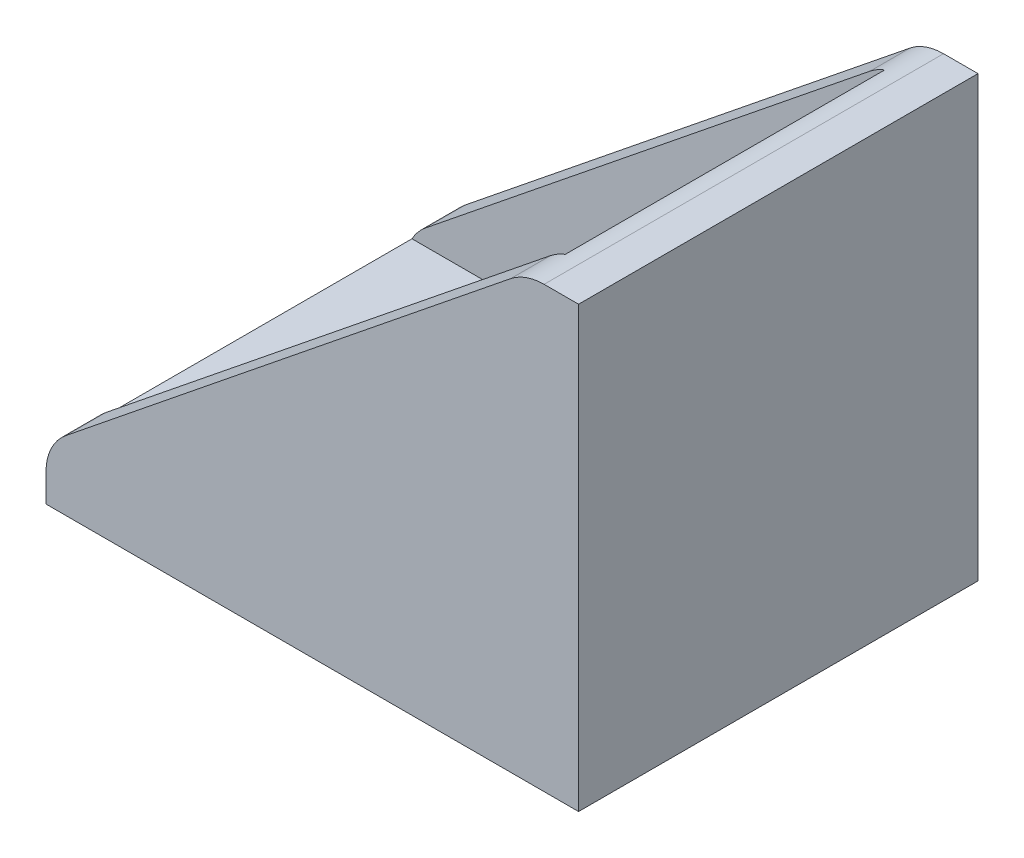
ISO-10303-21;
HEADER;
FILE_DESCRIPTION(('STEP AP214'),'2;1');
FILE_NAME('part.step','',(''),(''),'','','');
FILE_SCHEMA(('AUTOMOTIVE_DESIGN { 1 0 10303 214 1 1 1 1 }'));
ENDSEC;
DATA;
#1=APPLICATION_CONTEXT('core data for automotive mechanical design processes');
#2=APPLICATION_PROTOCOL_DEFINITION('international standard','automotive_design',2000,#1);
#3=PRODUCT_CONTEXT('',#1,'mechanical');
#4=PRODUCT('Part','Part','',(#3));
#5=PRODUCT_RELATED_PRODUCT_CATEGORY('part','',(#4));
#6=PRODUCT_DEFINITION_FORMATION('','',#4);
#7=PRODUCT_DEFINITION_CONTEXT('part definition',#1,'design');
#8=PRODUCT_DEFINITION('design','',#6,#7);
#9=PRODUCT_DEFINITION_SHAPE('','',#8);
#10=(LENGTH_UNIT() NAMED_UNIT(*) SI_UNIT(.MILLI.,.METRE.));
#11=(NAMED_UNIT(*) PLANE_ANGLE_UNIT() SI_UNIT($,.RADIAN.));
#12=(NAMED_UNIT(*) SI_UNIT($,.STERADIAN.) SOLID_ANGLE_UNIT());
#13=UNCERTAINTY_MEASURE_WITH_UNIT(LENGTH_MEASURE(1.E-05),#10,'distance_accuracy_value','');
#14=(GEOMETRIC_REPRESENTATION_CONTEXT(3) GLOBAL_UNCERTAINTY_ASSIGNED_CONTEXT((#13)) GLOBAL_UNIT_ASSIGNED_CONTEXT((#10,
#11,#12)) REPRESENTATION_CONTEXT('',''));
#15=CARTESIAN_POINT('',(0.,0.,0.));
#16=DIRECTION('',(0.,0.,1.));
#17=DIRECTION('',(1.,0.,0.));
#18=AXIS2_PLACEMENT_3D('',#15,#16,#17);
#19=CARTESIAN_POINT('',(-50.8,0.,38.1));
#20=DIRECTION('',(1.,0.,0.));
#21=DIRECTION('',(0.,0.,-1.));
#22=AXIS2_PLACEMENT_3D('',#19,#20,#21);
#23=PLANE('',#22);
#24=DIRECTION('',(0.,-1.,0.));
#25=VECTOR('',#24,1.);
#26=CARTESIAN_POINT('',(-50.8,0.,38.1));
#27=LINE('',#26,#25);
#28=CARTESIAN_POINT('',(-50.8,2.64898048854031,38.1));
#29=VERTEX_POINT('',#28);
#30=CARTESIAN_POINT('',(-50.8,0.,38.1));
#31=VERTEX_POINT('',#30);
#32=EDGE_CURVE('E204',#29,#31,#27,.T.);
#33=ORIENTED_EDGE('',*,*,#32,.F.);
#34=DIRECTION('',(0.,0.,-1.));
#35=VECTOR('',#34,1.);
#36=CARTESIAN_POINT('',(-50.8,2.64898048854031,0.));
#37=LINE('',#36,#35);
#38=CARTESIAN_POINT('',(-50.8,2.64898048854031,0.));
#39=VERTEX_POINT('',#38);
#40=EDGE_CURVE('E233',#29,#39,#37,.T.);
#41=ORIENTED_EDGE('',*,*,#40,.T.);
#42=DIRECTION('',(0.,-1.,0.));
#43=VECTOR('',#42,1.);
#44=CARTESIAN_POINT('',(-50.8,0.,0.));
#45=LINE('',#44,#43);
#46=CARTESIAN_POINT('',(-50.8,0.,0.));
#47=VERTEX_POINT('',#46);
#48=EDGE_CURVE('E201',#39,#47,#45,.T.);
#49=ORIENTED_EDGE('',*,*,#48,.T.);
#50=DIRECTION('',(0.,0.,-1.));
#51=VECTOR('',#50,1.);
#52=CARTESIAN_POINT('',(-50.8,0.,38.1));
#53=LINE('',#52,#51);
#54=EDGE_CURVE('E230',#31,#47,#53,.T.);
#55=ORIENTED_EDGE('',*,*,#54,.F.);
#56=EDGE_LOOP('',(#33,#41,#49,#55));
#57=FACE_BOUND('',#56,.T.);
#58=ADVANCED_FACE('F33',(#57),#23,.F.);
#59=CARTESIAN_POINT('',(-50.8,0.,38.1));
#60=DIRECTION('',(0.,1.,0.));
#61=DIRECTION('',(0.,0.,1.));
#62=AXIS2_PLACEMENT_3D('',#59,#60,#61);
#63=PLANE('',#62);
#64=DIRECTION('',(1.,0.,0.));
#65=VECTOR('',#64,1.);
#66=CARTESIAN_POINT('',(-40.3302771203879,0.,15.875));
#67=LINE('',#66,#65);
#68=CARTESIAN_POINT('',(-40.3302771203879,0.,15.875));
#69=VERTEX_POINT('',#68);
#70=CARTESIAN_POINT('',(-14.9302771203879,0.,15.875));
#71=VERTEX_POINT('',#70);
#72=EDGE_CURVE('E165',#69,#71,#67,.T.);
#73=ORIENTED_EDGE('',*,*,#72,.F.);
#74=CARTESIAN_POINT('',(-40.3302771203879,0.,19.05));
#75=DIRECTION('',(0.,1.,0.));
#76=DIRECTION('',(0.,0.,1.));
#77=AXIS2_PLACEMENT_3D('',#74,#75,#76);
#78=CIRCLE('',#77,3.175);
#79=CARTESIAN_POINT('',(-40.3302771203879,0.,22.225));
#80=VERTEX_POINT('',#79);
#81=EDGE_CURVE('E147',#80,#69,#78,.F.);
#82=ORIENTED_EDGE('',*,*,#81,.F.);
#83=DIRECTION('',(-1.,0.,0.));
#84=VECTOR('',#83,1.);
#85=CARTESIAN_POINT('',(-40.3302771203879,0.,22.225));
#86=LINE('',#85,#84);
#87=CARTESIAN_POINT('',(-14.9302771203879,0.,22.225));
#88=VERTEX_POINT('',#87);
#89=EDGE_CURVE('E156',#88,#80,#86,.T.);
#90=ORIENTED_EDGE('',*,*,#89,.F.);
#91=CARTESIAN_POINT('',(-14.9302771203879,0.,19.05));
#92=DIRECTION('',(0.,1.,0.));
#93=DIRECTION('',(0.,0.,1.));
#94=AXIS2_PLACEMENT_3D('',#91,#92,#93);
#95=CIRCLE('',#94,3.175);
#96=EDGE_CURVE('E48',#71,#88,#95,.F.);
#97=ORIENTED_EDGE('',*,*,#96,.F.);
#98=EDGE_LOOP('',(#73,#82,#90,#97));
#99=FACE_BOUND('',#98,.T.);
#100=DIRECTION('',(1.,0.,0.));
#101=VECTOR('',#100,1.);
#102=CARTESIAN_POINT('',(-50.8,0.,0.));
#103=LINE('',#102,#101);
#104=CARTESIAN_POINT('',(0.,0.,0.));
#105=VERTEX_POINT('',#104);
#106=EDGE_CURVE('E216',#47,#105,#103,.T.);
#107=ORIENTED_EDGE('',*,*,#106,.T.);
#108=DIRECTION('',(0.,0.,-1.));
#109=VECTOR('',#108,1.);
#110=CARTESIAN_POINT('',(0.,0.,38.1));
#111=LINE('',#110,#109);
#112=CARTESIAN_POINT('',(0.,0.,38.1));
#113=VERTEX_POINT('',#112);
#114=EDGE_CURVE('E227',#113,#105,#111,.T.);
#115=ORIENTED_EDGE('',*,*,#114,.F.);
#116=DIRECTION('',(1.,0.,0.));
#117=VECTOR('',#116,1.);
#118=CARTESIAN_POINT('',(-50.8,0.,38.1));
#119=LINE('',#118,#117);
#120=EDGE_CURVE('E206',#31,#113,#119,.T.);
#121=ORIENTED_EDGE('',*,*,#120,.F.);
#122=ORIENTED_EDGE('',*,*,#54,.T.);
#123=EDGE_LOOP('',(#107,#115,#121,#122));
#124=FACE_BOUND('',#123,.T.);
#125=ADVANCED_FACE('F162',(#99,#124),#63,.F.);
#126=CARTESIAN_POINT('',(0.,0.,38.1));
#127=DIRECTION('',(-1.,0.,0.));
#128=DIRECTION('',(0.,0.,1.));
#129=AXIS2_PLACEMENT_3D('',#126,#127,#128);
#130=PLANE('',#129);
#131=DIRECTION('',(0.,1.,0.));
#132=VECTOR('',#131,1.);
#133=CARTESIAN_POINT('',(0.,0.,0.));
#134=LINE('',#133,#132);
#135=CARTESIAN_POINT('',(0.,41.91,0.));
#136=VERTEX_POINT('',#135);
#137=EDGE_CURVE('E218',#105,#136,#134,.T.);
#138=ORIENTED_EDGE('',*,*,#137,.T.);
#139=DIRECTION('',(0.,0.,-1.));
#140=VECTOR('',#139,1.);
#141=CARTESIAN_POINT('',(0.,41.91,38.1));
#142=LINE('',#141,#140);
#143=CARTESIAN_POINT('',(0.,41.91,38.1));
#144=VERTEX_POINT('',#143);
#145=EDGE_CURVE('E224',#144,#136,#142,.T.);
#146=ORIENTED_EDGE('',*,*,#145,.F.);
#147=DIRECTION('',(0.,1.,0.));
#148=VECTOR('',#147,1.);
#149=CARTESIAN_POINT('',(0.,0.,38.1));
#150=LINE('',#149,#148);
#151=EDGE_CURVE('E209',#113,#144,#150,.T.);
#152=ORIENTED_EDGE('',*,*,#151,.F.);
#153=ORIENTED_EDGE('',*,*,#114,.T.);
#154=EDGE_LOOP('',(#138,#146,#152,#153));
#155=FACE_BOUND('',#154,.T.);
#156=ADVANCED_FACE('F309',(#155),#130,.F.);
#157=CARTESIAN_POINT('',(0.,41.91,38.1));
#158=DIRECTION('',(0.,-1.,0.));
#159=DIRECTION('',(0.,0.,-1.));
#160=AXIS2_PLACEMENT_3D('',#157,#158,#159);
#161=PLANE('',#160);
#162=DIRECTION('',(-1.,0.,0.));
#163=VECTOR('',#162,1.);
#164=CARTESIAN_POINT('',(0.,41.91,0.));
#165=LINE('',#164,#163);
#166=CARTESIAN_POINT('',(-3.28838957198108,41.91,0.));
#167=VERTEX_POINT('',#166);
#168=EDGE_CURVE('E207',#136,#167,#165,.T.);
#169=ORIENTED_EDGE('',*,*,#168,.T.);
#170=DIRECTION('',(0.,0.,-1.));
#171=VECTOR('',#170,1.);
#172=CARTESIAN_POINT('',(-3.28838957198108,41.91,3.81000000000001));
#173=LINE('',#172,#171);
#174=CARTESIAN_POINT('',(-3.28838957198108,41.91,38.1));
#175=VERTEX_POINT('',#174);
#176=EDGE_CURVE('E41',#167,#175,#173,.F.);
#177=ORIENTED_EDGE('',*,*,#176,.T.);
#178=DIRECTION('',(-1.,0.,0.));
#179=VECTOR('',#178,1.);
#180=CARTESIAN_POINT('',(0.,41.91,38.1));
#181=LINE('',#180,#179);
#182=EDGE_CURVE('E211',#144,#175,#181,.T.);
#183=ORIENTED_EDGE('',*,*,#182,.F.);
#184=ORIENTED_EDGE('',*,*,#145,.T.);
#185=EDGE_LOOP('',(#169,#177,#183,#184));
#186=FACE_BOUND('',#185,.T.);
#187=ADVANCED_FACE('F265',(#186),#161,.F.);
#188=CARTESIAN_POINT('',(-5.08,5.08,38.1));
#189=DIRECTION('',(1.,0.,0.));
#190=DIRECTION('',(0.,0.,-1.));
#191=AXIS2_PLACEMENT_3D('',#188,#189,#190);
#192=PLANE('',#191);
#193=DIRECTION('',(0.,1.,0.));
#194=VECTOR('',#193,1.);
#195=CARTESIAN_POINT('',(-5.08,5.08,34.29));
#196=LINE('',#195,#194);
#197=CARTESIAN_POINT('',(-5.08,5.08,34.29));
#198=VERTEX_POINT('',#197);
#199=CARTESIAN_POINT('',(-5.08,41.5835809737727,34.29));
#200=VERTEX_POINT('',#199);
#201=EDGE_CURVE('E187',#198,#200,#196,.T.);
#202=ORIENTED_EDGE('',*,*,#201,.T.);
#203=DIRECTION('',(0.,0.,1.));
#204=VECTOR('',#203,1.);
#205=CARTESIAN_POINT('',(-5.08,41.5835809737727,34.29));
#206=LINE('',#205,#204);
#207=CARTESIAN_POINT('',(-5.08,41.5835809737727,3.81));
#208=VERTEX_POINT('',#207);
#209=EDGE_CURVE('E11',#200,#208,#206,.F.);
#210=ORIENTED_EDGE('',*,*,#209,.T.);
#211=DIRECTION('',(0.,1.,0.));
#212=VECTOR('',#211,1.);
#213=CARTESIAN_POINT('',(-5.08,5.08,3.81));
#214=LINE('',#213,#212);
#215=CARTESIAN_POINT('',(-5.08,5.08,3.81000000000001));
#216=VERTEX_POINT('',#215);
#217=EDGE_CURVE('E195',#216,#208,#214,.T.);
#218=ORIENTED_EDGE('',*,*,#217,.F.);
#219=DIRECTION('',(0.,0.,-1.));
#220=VECTOR('',#219,1.);
#221=CARTESIAN_POINT('',(-5.08,5.08,38.1));
#222=LINE('',#221,#220);
#223=EDGE_CURVE('E214',#198,#216,#222,.T.);
#224=ORIENTED_EDGE('',*,*,#223,.F.);
#225=EDGE_LOOP('',(#202,#210,#218,#224));
#226=FACE_BOUND('',#225,.T.);
#227=ADVANCED_FACE('F346',(#226),#192,.F.);
#228=CARTESIAN_POINT('',(-50.8,5.08,38.1));
#229=DIRECTION('',(0.,-1.,0.));
#230=DIRECTION('',(0.,0.,-1.));
#231=AXIS2_PLACEMENT_3D('',#228,#229,#230);
#232=PLANE('',#231);
#233=DIRECTION('',(1.,0.,0.));
#234=VECTOR('',#233,1.);
#235=CARTESIAN_POINT('',(-40.3302771203879,5.08,22.225));
#236=LINE('',#235,#234);
#237=CARTESIAN_POINT('',(-40.3302771203879,5.08,22.225));
#238=VERTEX_POINT('',#237);
#239=CARTESIAN_POINT('',(-14.9302771203879,5.08,22.225));
#240=VERTEX_POINT('',#239);
#241=EDGE_CURVE('E167',#238,#240,#236,.T.);
#242=ORIENTED_EDGE('',*,*,#241,.F.);
#243=CARTESIAN_POINT('',(-40.3302771203879,5.08,19.05));
#244=DIRECTION('',(0.,1.,0.));
#245=DIRECTION('',(0.,0.,1.));
#246=AXIS2_PLACEMENT_3D('',#243,#244,#245);
#247=CIRCLE('',#246,3.175);
#248=CARTESIAN_POINT('',(-40.3302771203879,5.08,15.875));
#249=VERTEX_POINT('',#248);
#250=EDGE_CURVE('E56',#249,#238,#247,.T.);
#251=ORIENTED_EDGE('',*,*,#250,.F.);
#252=DIRECTION('',(-1.,0.,0.));
#253=VECTOR('',#252,1.);
#254=CARTESIAN_POINT('',(-40.3302771203879,5.08,15.875));
#255=LINE('',#254,#253);
#256=CARTESIAN_POINT('',(-14.9302771203879,5.08,15.875));
#257=VERTEX_POINT('',#256);
#258=EDGE_CURVE('E153',#257,#249,#255,.T.);
#259=ORIENTED_EDGE('',*,*,#258,.F.);
#260=CARTESIAN_POINT('',(-14.9302771203879,5.08,19.05));
#261=DIRECTION('',(0.,1.,0.));
#262=DIRECTION('',(0.,0.,1.));
#263=AXIS2_PLACEMENT_3D('',#260,#261,#262);
#264=CIRCLE('',#263,3.175);
#265=EDGE_CURVE('E173',#240,#257,#264,.T.);
#266=ORIENTED_EDGE('',*,*,#265,.F.);
#267=EDGE_LOOP('',(#242,#251,#259,#266));
#268=FACE_BOUND('',#267,.T.);
#269=DIRECTION('',(1.,0.,0.));
#270=VECTOR('',#269,1.);
#271=CARTESIAN_POINT('',(-50.8,5.08,3.81));
#272=LINE('',#271,#270);
#273=CARTESIAN_POINT('',(-50.1805542407757,5.08,3.81));
#274=VERTEX_POINT('',#273);
#275=EDGE_CURVE('E193',#274,#216,#272,.T.);
#276=ORIENTED_EDGE('',*,*,#275,.F.);
#277=DIRECTION('',(0.,0.,1.));
#278=VECTOR('',#277,1.);
#279=CARTESIAN_POINT('',(-50.1805542407757,5.08,3.81));
#280=LINE('',#279,#278);
#281=CARTESIAN_POINT('',(-50.1805542407757,5.08,34.29));
#282=VERTEX_POINT('',#281);
#283=EDGE_CURVE('E249',#274,#282,#280,.T.);
#284=ORIENTED_EDGE('',*,*,#283,.T.);
#285=DIRECTION('',(1.,0.,0.));
#286=VECTOR('',#285,1.);
#287=CARTESIAN_POINT('',(-50.8,5.08,34.29));
#288=LINE('',#287,#286);
#289=EDGE_CURVE('E182',#282,#198,#288,.T.);
#290=ORIENTED_EDGE('',*,*,#289,.T.);
#291=ORIENTED_EDGE('',*,*,#223,.T.);
#292=EDGE_LOOP('',(#276,#284,#290,#291));
#293=FACE_BOUND('',#292,.T.);
#294=ADVANCED_FACE('F341',(#268,#293),#232,.F.);
#295=CARTESIAN_POINT('',(0.,0.,38.1));
#296=DIRECTION('',(0.,0.,-1.));
#297=DIRECTION('',(-1.,0.,0.));
#298=AXIS2_PLACEMENT_3D('',#295,#296,#297);
#299=PLANE('',#298);
#300=DIRECTION('',(0.778753909083283,0.627329537872645,0.));
#301=VECTOR('',#300,1.);
#302=CARTESIAN_POINT('',(-50.8,5.08,38.1));
#303=LINE('',#302,#301);
#304=CARTESIAN_POINT('',(-48.906834052393,6.60505034668339,38.1));
#305=VERTEX_POINT('',#304);
#306=CARTESIAN_POINT('',(-6.47522362437411,40.7860698581431,38.1));
#307=VERTEX_POINT('',#306);
#308=EDGE_CURVE('E159',#305,#307,#303,.T.);
#309=ORIENTED_EDGE('',*,*,#308,.F.);
#310=CARTESIAN_POINT('',(-45.72,2.64898048854031,38.1));
#311=DIRECTION('',(0.,0.,-1.));
#312=DIRECTION('',(-1.,0.,0.));
#313=AXIS2_PLACEMENT_3D('',#310,#311,#312);
#314=CIRCLE('',#313,5.08);
#315=EDGE_CURVE('E261',#305,#29,#314,.F.);
#316=ORIENTED_EDGE('',*,*,#315,.T.);
#317=ORIENTED_EDGE('',*,*,#32,.T.);
#318=ORIENTED_EDGE('',*,*,#120,.T.);
#319=ORIENTED_EDGE('',*,*,#151,.T.);
#320=ORIENTED_EDGE('',*,*,#182,.T.);
#321=CARTESIAN_POINT('',(-3.28838957198108,36.83,38.1));
#322=DIRECTION('',(0.,0.,-1.));
#323=DIRECTION('',(-1.,0.,0.));
#324=AXIS2_PLACEMENT_3D('',#321,#322,#323);
#325=CIRCLE('',#324,5.08);
#326=EDGE_CURVE('E259',#175,#307,#325,.F.);
#327=ORIENTED_EDGE('',*,*,#326,.T.);
#328=EDGE_LOOP('',(#309,#316,#317,#318,#319,#320,#327));
#329=FACE_BOUND('',#328,.T.);
#330=ADVANCED_FACE('F271',(#329),#299,.F.);
#331=CARTESIAN_POINT('',(0.,0.,0.));
#332=DIRECTION('',(0.,0.,-1.));
#333=DIRECTION('',(-1.,0.,0.));
#334=AXIS2_PLACEMENT_3D('',#331,#332,#333);
#335=PLANE('',#334);
#336=ORIENTED_EDGE('',*,*,#48,.F.);
#337=CARTESIAN_POINT('',(-45.72,2.64898048854031,0.));
#338=DIRECTION('',(0.,0.,-1.));
#339=DIRECTION('',(-1.,0.,0.));
#340=AXIS2_PLACEMENT_3D('',#337,#338,#339);
#341=CIRCLE('',#340,5.08);
#342=CARTESIAN_POINT('',(-48.906834052393,6.60505034668339,0.));
#343=VERTEX_POINT('',#342);
#344=EDGE_CURVE('E238',#39,#343,#341,.T.);
#345=ORIENTED_EDGE('',*,*,#344,.T.);
#346=DIRECTION('',(0.778753909083283,0.627329537872645,0.));
#347=VECTOR('',#346,1.);
#348=CARTESIAN_POINT('',(-50.8,5.08,0.));
#349=LINE('',#348,#347);
#350=CARTESIAN_POINT('',(-6.47522362437412,40.7860698581431,0.));
#351=VERTEX_POINT('',#350);
#352=EDGE_CURVE('E190',#343,#351,#349,.T.);
#353=ORIENTED_EDGE('',*,*,#352,.T.);
#354=CARTESIAN_POINT('',(-3.28838957198108,36.83,0.));
#355=DIRECTION('',(0.,0.,-1.));
#356=DIRECTION('',(-1.,0.,0.));
#357=AXIS2_PLACEMENT_3D('',#354,#355,#356);
#358=CIRCLE('',#357,5.08);
#359=EDGE_CURVE('E236',#351,#167,#358,.T.);
#360=ORIENTED_EDGE('',*,*,#359,.T.);
#361=ORIENTED_EDGE('',*,*,#168,.F.);
#362=ORIENTED_EDGE('',*,*,#137,.F.);
#363=ORIENTED_EDGE('',*,*,#106,.F.);
#364=EDGE_LOOP('',(#336,#345,#353,#360,#361,#362,#363));
#365=FACE_BOUND('',#364,.T.);
#366=ADVANCED_FACE('F300',(#365),#335,.T.);
#367=CARTESIAN_POINT('',(-50.8,5.08,3.81));
#368=DIRECTION('',(-0.627329537872645,0.778753909083283,0.));
#369=DIRECTION('',(-0.778753909083283,-0.627329537872645,0.));
#370=AXIS2_PLACEMENT_3D('',#367,#368,#369);
#371=PLANE('',#370);
#372=ORIENTED_EDGE('',*,*,#352,.F.);
#373=DIRECTION('',(0.,0.,-1.));
#374=VECTOR('',#373,1.);
#375=CARTESIAN_POINT('',(-48.906834052393,6.60505034668339,3.81000000000001));
#376=LINE('',#375,#374);
#377=CARTESIAN_POINT('',(-48.906834052393,6.60505034668339,3.81));
#378=VERTEX_POINT('',#377);
#379=EDGE_CURVE('E243',#343,#378,#376,.F.);
#380=ORIENTED_EDGE('',*,*,#379,.T.);
#381=DIRECTION('',(0.778753909083283,0.627329537872645,0.));
#382=VECTOR('',#381,1.);
#383=CARTESIAN_POINT('',(-50.8,5.08,3.81));
#384=LINE('',#383,#382);
#385=CARTESIAN_POINT('',(-6.47522362437412,40.7860698581431,3.81));
#386=VERTEX_POINT('',#385);
#387=EDGE_CURVE('E198',#378,#386,#384,.T.);
#388=ORIENTED_EDGE('',*,*,#387,.T.);
#389=DIRECTION('',(0.,0.,-1.));
#390=VECTOR('',#389,1.);
#391=CARTESIAN_POINT('',(-6.47522362437411,40.7860698581431,0.));
#392=LINE('',#391,#390);
#393=EDGE_CURVE('E240',#386,#351,#392,.T.);
#394=ORIENTED_EDGE('',*,*,#393,.T.);
#395=EDGE_LOOP('',(#372,#380,#388,#394));
#396=FACE_BOUND('',#395,.T.);
#397=ADVANCED_FACE('F303',(#396),#371,.T.);
#398=CARTESIAN_POINT('',(0.,0.,3.81));
#399=DIRECTION('',(0.,0.,1.));
#400=DIRECTION('',(1.,0.,0.));
#401=AXIS2_PLACEMENT_3D('',#398,#399,#400);
#402=PLANE('',#401);
#403=ORIENTED_EDGE('',*,*,#387,.F.);
#404=CARTESIAN_POINT('',(-45.72,2.64898048854031,3.81));
#405=DIRECTION('',(0.,0.,1.));
#406=DIRECTION('',(1.,0.,0.));
#407=AXIS2_PLACEMENT_3D('',#404,#405,#406);
#408=CIRCLE('',#407,5.08);
#409=EDGE_CURVE('E247',#378,#274,#408,.T.);
#410=ORIENTED_EDGE('',*,*,#409,.T.);
#411=ORIENTED_EDGE('',*,*,#275,.T.);
#412=ORIENTED_EDGE('',*,*,#217,.T.);
#413=CARTESIAN_POINT('',(-3.28838957198108,36.83,3.81));
#414=DIRECTION('',(0.,0.,1.));
#415=DIRECTION('',(1.,0.,0.));
#416=AXIS2_PLACEMENT_3D('',#413,#414,#415);
#417=CIRCLE('',#416,5.08);
#418=EDGE_CURVE('E245',#208,#386,#417,.T.);
#419=ORIENTED_EDGE('',*,*,#418,.T.);
#420=EDGE_LOOP('',(#403,#410,#411,#412,#419));
#421=FACE_BOUND('',#420,.T.);
#422=ADVANCED_FACE('F329',(#421),#402,.T.);
#423=CARTESIAN_POINT('',(-50.8,5.08,34.29));
#424=DIRECTION('',(0.627329537872645,-0.778753909083283,0.));
#425=DIRECTION('',(0.778753909083283,0.627329537872645,0.));
#426=AXIS2_PLACEMENT_3D('',#423,#424,#425);
#427=PLANE('',#426);
#428=DIRECTION('',(0.778753909083283,0.627329537872645,0.));
#429=VECTOR('',#428,1.);
#430=CARTESIAN_POINT('',(-50.8,5.08,34.29));
#431=LINE('',#430,#429);
#432=CARTESIAN_POINT('',(-48.906834052393,6.60505034668339,34.29));
#433=VERTEX_POINT('',#432);
#434=CARTESIAN_POINT('',(-6.47522362437411,40.7860698581431,34.29));
#435=VERTEX_POINT('',#434);
#436=EDGE_CURVE('E184',#433,#435,#431,.T.);
#437=ORIENTED_EDGE('',*,*,#436,.F.);
#438=DIRECTION('',(0.,0.,1.));
#439=VECTOR('',#438,1.);
#440=CARTESIAN_POINT('',(-48.906834052393,6.60505034668339,36.195));
#441=LINE('',#440,#439);
#442=EDGE_CURVE('E257',#433,#305,#441,.T.);
#443=ORIENTED_EDGE('',*,*,#442,.T.);
#444=ORIENTED_EDGE('',*,*,#308,.T.);
#445=DIRECTION('',(0.,0.,1.));
#446=VECTOR('',#445,1.);
#447=CARTESIAN_POINT('',(-6.47522362437412,40.7860698581431,36.195));
#448=LINE('',#447,#446);
#449=EDGE_CURVE('E255',#307,#435,#448,.F.);
#450=ORIENTED_EDGE('',*,*,#449,.T.);
#451=EDGE_LOOP('',(#437,#443,#444,#450));
#452=FACE_BOUND('',#451,.T.);
#453=ADVANCED_FACE('F279',(#452),#427,.F.);
#454=CARTESIAN_POINT('',(0.,0.,34.29));
#455=DIRECTION('',(0.,0.,-1.));
#456=DIRECTION('',(1.,0.,0.));
#457=AXIS2_PLACEMENT_3D('',#454,#455,#456);
#458=PLANE('',#457);
#459=ORIENTED_EDGE('',*,*,#289,.F.);
#460=CARTESIAN_POINT('',(-45.72,2.64898048854031,34.29));
#461=DIRECTION('',(0.,0.,-1.));
#462=DIRECTION('',(-1.,0.,0.));
#463=AXIS2_PLACEMENT_3D('',#460,#461,#462);
#464=CIRCLE('',#463,5.08);
#465=EDGE_CURVE('E253',#282,#433,#464,.T.);
#466=ORIENTED_EDGE('',*,*,#465,.T.);
#467=ORIENTED_EDGE('',*,*,#436,.T.);
#468=CARTESIAN_POINT('',(-3.28838957198108,36.83,34.29));
#469=DIRECTION('',(0.,0.,-1.));
#470=DIRECTION('',(-1.,0.,0.));
#471=AXIS2_PLACEMENT_3D('',#468,#469,#470);
#472=CIRCLE('',#471,5.08);
#473=EDGE_CURVE('E251',#435,#200,#472,.T.);
#474=ORIENTED_EDGE('',*,*,#473,.T.);
#475=ORIENTED_EDGE('',*,*,#201,.F.);
#476=EDGE_LOOP('',(#459,#466,#467,#474,#475));
#477=FACE_BOUND('',#476,.T.);
#478=ADVANCED_FACE('F283',(#477),#458,.T.);
#479=CARTESIAN_POINT('',(-45.72,2.64898048854031,38.1));
#480=DIRECTION('',(0.,0.,1.));
#481=DIRECTION('',(1.,0.,0.));
#482=AXIS2_PLACEMENT_3D('',#479,#480,#481);
#483=CYLINDRICAL_SURFACE('',#482,5.08);
#484=ORIENTED_EDGE('',*,*,#409,.F.);
#485=ORIENTED_EDGE('',*,*,#379,.F.);
#486=ORIENTED_EDGE('',*,*,#344,.F.);
#487=ORIENTED_EDGE('',*,*,#40,.F.);
#488=ORIENTED_EDGE('',*,*,#315,.F.);
#489=ORIENTED_EDGE('',*,*,#442,.F.);
#490=ORIENTED_EDGE('',*,*,#465,.F.);
#491=ORIENTED_EDGE('',*,*,#283,.F.);
#492=EDGE_LOOP('',(#484,#485,#486,#487,#488,#489,#490,#491));
#493=FACE_BOUND('',#492,.T.);
#494=ADVANCED_FACE('F289',(#493),#483,.T.);
#495=CARTESIAN_POINT('',(-3.28838957198108,36.83,3.81));
#496=DIRECTION('',(0.,0.,1.));
#497=DIRECTION('',(1.,0.,0.));
#498=AXIS2_PLACEMENT_3D('',#495,#496,#497);
#499=CYLINDRICAL_SURFACE('',#498,5.08);
#500=ORIENTED_EDGE('',*,*,#326,.F.);
#501=ORIENTED_EDGE('',*,*,#176,.F.);
#502=ORIENTED_EDGE('',*,*,#359,.F.);
#503=ORIENTED_EDGE('',*,*,#393,.F.);
#504=ORIENTED_EDGE('',*,*,#418,.F.);
#505=ORIENTED_EDGE('',*,*,#209,.F.);
#506=ORIENTED_EDGE('',*,*,#473,.F.);
#507=ORIENTED_EDGE('',*,*,#449,.F.);
#508=EDGE_LOOP('',(#500,#501,#502,#503,#504,#505,#506,#507));
#509=FACE_BOUND('',#508,.T.);
#510=ADVANCED_FACE('F35',(#509),#499,.T.);
#511=CARTESIAN_POINT('',(-40.3302771203879,-0.00100000000000013,19.05));
#512=DIRECTION('',(0.,1.,0.));
#513=DIRECTION('',(0.,0.,1.));
#514=AXIS2_PLACEMENT_3D('',#511,#512,#513);
#515=CYLINDRICAL_SURFACE('',#514,3.175);
#516=ORIENTED_EDGE('',*,*,#81,.T.);
#517=DIRECTION('',(0.,1.,0.));
#518=VECTOR('',#517,1.);
#519=CARTESIAN_POINT('',(-40.3302771203879,-0.00100000000000013,15.875));
#520=LINE('',#519,#518);
#521=EDGE_CURVE('E160',#69,#249,#520,.T.);
#522=ORIENTED_EDGE('',*,*,#521,.T.);
#523=ORIENTED_EDGE('',*,*,#250,.T.);
#524=DIRECTION('',(0.,1.,0.));
#525=VECTOR('',#524,1.);
#526=CARTESIAN_POINT('',(-40.3302771203879,-0.00100000000000013,22.225));
#527=LINE('',#526,#525);
#528=EDGE_CURVE('E143',#80,#238,#527,.T.);
#529=ORIENTED_EDGE('',*,*,#528,.F.);
#530=EDGE_LOOP('',(#516,#522,#523,#529));
#531=FACE_BOUND('',#530,.T.);
#532=ADVANCED_FACE('F145',(#531),#515,.F.);
#533=CARTESIAN_POINT('',(-40.3302771203879,-0.00100000000000013,15.875));
#534=DIRECTION('',(0.,0.,-1.));
#535=DIRECTION('',(-1.,0.,0.));
#536=AXIS2_PLACEMENT_3D('',#533,#534,#535);
#537=PLANE('',#536);
#538=ORIENTED_EDGE('',*,*,#72,.T.);
#539=DIRECTION('',(0.,1.,0.));
#540=VECTOR('',#539,1.);
#541=CARTESIAN_POINT('',(-14.9302771203879,-0.00100000000000013,15.875));
#542=LINE('',#541,#540);
#543=EDGE_CURVE('E179',#71,#257,#542,.T.);
#544=ORIENTED_EDGE('',*,*,#543,.T.);
#545=ORIENTED_EDGE('',*,*,#258,.T.);
#546=ORIENTED_EDGE('',*,*,#521,.F.);
#547=EDGE_LOOP('',(#538,#544,#545,#546));
#548=FACE_BOUND('',#547,.T.);
#549=ADVANCED_FACE('F440',(#548),#537,.F.);
#550=CARTESIAN_POINT('',(-14.9302771203879,-0.00100000000000013,19.05));
#551=DIRECTION('',(0.,1.,0.));
#552=DIRECTION('',(0.,0.,1.));
#553=AXIS2_PLACEMENT_3D('',#550,#551,#552);
#554=CYLINDRICAL_SURFACE('',#553,3.175);
#555=ORIENTED_EDGE('',*,*,#96,.T.);
#556=DIRECTION('',(0.,1.,0.));
#557=VECTOR('',#556,1.);
#558=CARTESIAN_POINT('',(-14.9302771203879,-0.00100000000000013,22.225));
#559=LINE('',#558,#557);
#560=EDGE_CURVE('E152',#88,#240,#559,.T.);
#561=ORIENTED_EDGE('',*,*,#560,.T.);
#562=ORIENTED_EDGE('',*,*,#265,.T.);
#563=ORIENTED_EDGE('',*,*,#543,.F.);
#564=EDGE_LOOP('',(#555,#561,#562,#563));
#565=FACE_BOUND('',#564,.T.);
#566=ADVANCED_FACE('F445',(#565),#554,.F.);
#567=CARTESIAN_POINT('',(-40.3302771203879,-0.00100000000000013,22.225));
#568=DIRECTION('',(0.,0.,1.));
#569=DIRECTION('',(1.,0.,0.));
#570=AXIS2_PLACEMENT_3D('',#567,#568,#569);
#571=PLANE('',#570);
#572=ORIENTED_EDGE('',*,*,#89,.T.);
#573=ORIENTED_EDGE('',*,*,#528,.T.);
#574=ORIENTED_EDGE('',*,*,#241,.T.);
#575=ORIENTED_EDGE('',*,*,#560,.F.);
#576=EDGE_LOOP('',(#572,#573,#574,#575));
#577=FACE_BOUND('',#576,.T.);
#578=ADVANCED_FACE('F157',(#577),#571,.F.);
#579=CLOSED_SHELL('',(#58,#125,#156,#187,#227,#294,#330,#366,#397,#422,#453,#478,#494,#510,#532,
#549,#566,#578));
#580=MANIFOLD_SOLID_BREP('B2',#579);
#581=ADVANCED_BREP_SHAPE_REPRESENTATION('',(#18,#580),#14);
#582=SHAPE_DEFINITION_REPRESENTATION(#9,#581);
ENDSEC;
END-ISO-10303-21;
